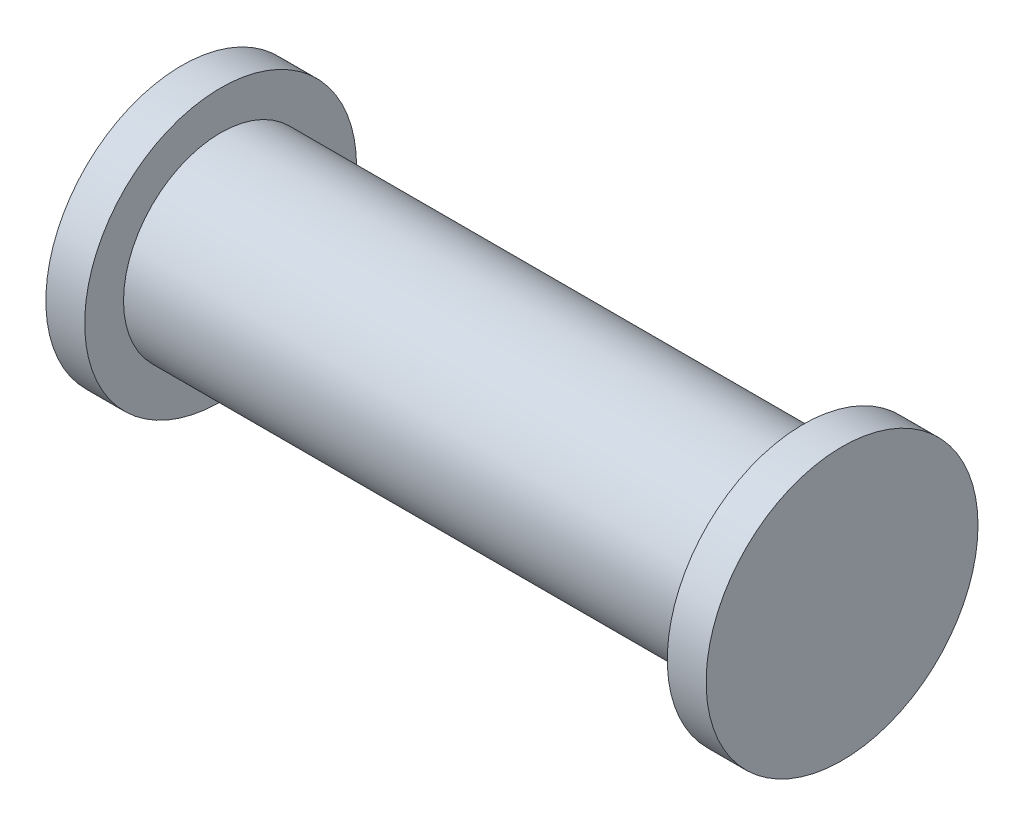
ISO-10303-21;
HEADER;
FILE_DESCRIPTION(('STEP AP214'),'2;1');
FILE_NAME('part.step','',(''),(''),'','','');
FILE_SCHEMA(('AUTOMOTIVE_DESIGN { 1 0 10303 214 1 1 1 1 }'));
ENDSEC;
DATA;
#1=APPLICATION_CONTEXT('core data for automotive mechanical design processes');
#2=APPLICATION_PROTOCOL_DEFINITION('international standard','automotive_design',2000,#1);
#3=PRODUCT_CONTEXT('',#1,'mechanical');
#4=PRODUCT('Part','Part','',(#3));
#5=PRODUCT_RELATED_PRODUCT_CATEGORY('part','',(#4));
#6=PRODUCT_DEFINITION_FORMATION('','',#4);
#7=PRODUCT_DEFINITION_CONTEXT('part definition',#1,'design');
#8=PRODUCT_DEFINITION('design','',#6,#7);
#9=PRODUCT_DEFINITION_SHAPE('','',#8);
#10=(LENGTH_UNIT() NAMED_UNIT(*) SI_UNIT(.MILLI.,.METRE.));
#11=(NAMED_UNIT(*) PLANE_ANGLE_UNIT() SI_UNIT($,.RADIAN.));
#12=(NAMED_UNIT(*) SI_UNIT($,.STERADIAN.) SOLID_ANGLE_UNIT());
#13=UNCERTAINTY_MEASURE_WITH_UNIT(LENGTH_MEASURE(1.E-05),#10,'distance_accuracy_value','');
#14=(GEOMETRIC_REPRESENTATION_CONTEXT(3) GLOBAL_UNCERTAINTY_ASSIGNED_CONTEXT((#13)) GLOBAL_UNIT_ASSIGNED_CONTEXT((#10,
#11,#12)) REPRESENTATION_CONTEXT('',''));
#15=CARTESIAN_POINT('',(0.,0.,0.));
#16=DIRECTION('',(0.,0.,1.));
#17=DIRECTION('',(1.,0.,0.));
#18=AXIS2_PLACEMENT_3D('',#15,#16,#17);
#19=CARTESIAN_POINT('',(37.5,0.,0.));
#20=DIRECTION('',(-1.,0.,0.));
#21=DIRECTION('',(0.,0.,1.));
#22=AXIS2_PLACEMENT_3D('',#19,#20,#21);
#23=CYLINDRICAL_SURFACE('',#22,12.5);
#24=CARTESIAN_POINT('',(37.5,0.,0.));
#25=DIRECTION('',(1.,0.,0.));
#26=DIRECTION('',(0.,0.,-1.));
#27=AXIS2_PLACEMENT_3D('',#24,#25,#26);
#28=CIRCLE('',#27,12.5);
#29=CARTESIAN_POINT('',(37.5,0.,-12.5));
#30=VERTEX_POINT('',#29);
#31=EDGE_CURVE('E10',#30,#30,#28,.T.);
#32=ORIENTED_EDGE('',*,*,#31,.F.);
#33=EDGE_LOOP('',(#32));
#34=FACE_BOUND('',#33,.T.);
#35=CARTESIAN_POINT('',(-37.5,0.,0.));
#36=DIRECTION('',(-1.,0.,0.));
#37=DIRECTION('',(0.,0.,1.));
#38=AXIS2_PLACEMENT_3D('',#35,#36,#37);
#39=CIRCLE('',#38,12.5);
#40=CARTESIAN_POINT('',(-37.5,0.,12.5));
#41=VERTEX_POINT('',#40);
#42=EDGE_CURVE('E48',#41,#41,#39,.T.);
#43=ORIENTED_EDGE('',*,*,#42,.F.);
#44=EDGE_LOOP('',(#43));
#45=FACE_BOUND('',#44,.T.);
#46=ADVANCED_FACE('F33',(#34,#45),#23,.T.);
#47=CARTESIAN_POINT('',(42.5,0.,0.));
#48=DIRECTION('',(-1.,0.,0.));
#49=DIRECTION('',(0.,0.,1.));
#50=AXIS2_PLACEMENT_3D('',#47,#48,#49);
#51=CYLINDRICAL_SURFACE('',#50,17.5);
#52=CARTESIAN_POINT('',(42.5,0.,0.));
#53=DIRECTION('',(1.,0.,0.));
#54=DIRECTION('',(0.,0.,-1.));
#55=AXIS2_PLACEMENT_3D('',#52,#53,#54);
#56=CIRCLE('',#55,17.5);
#57=CARTESIAN_POINT('',(42.5,0.,-17.5));
#58=VERTEX_POINT('',#57);
#59=EDGE_CURVE('E39',#58,#58,#56,.T.);
#60=ORIENTED_EDGE('',*,*,#59,.F.);
#61=EDGE_LOOP('',(#60));
#62=FACE_BOUND('',#61,.T.);
#63=CARTESIAN_POINT('',(37.5,0.,0.));
#64=DIRECTION('',(1.,0.,0.));
#65=DIRECTION('',(0.,0.,-1.));
#66=AXIS2_PLACEMENT_3D('',#63,#64,#65);
#67=CIRCLE('',#66,17.5);
#68=CARTESIAN_POINT('',(37.5,0.,-17.5));
#69=VERTEX_POINT('',#68);
#70=EDGE_CURVE('E43',#69,#69,#67,.T.);
#71=ORIENTED_EDGE('',*,*,#70,.T.);
#72=EDGE_LOOP('',(#71));
#73=FACE_BOUND('',#72,.T.);
#74=ADVANCED_FACE('F75',(#62,#73),#51,.T.);
#75=CARTESIAN_POINT('',(42.5,0.,0.));
#76=DIRECTION('',(1.,0.,0.));
#77=DIRECTION('',(0.,0.,-1.));
#78=AXIS2_PLACEMENT_3D('',#75,#76,#77);
#79=PLANE('',#78);
#80=ORIENTED_EDGE('',*,*,#59,.T.);
#81=EDGE_LOOP('',(#80));
#82=FACE_BOUND('',#81,.T.);
#83=ADVANCED_FACE('F80',(#82),#79,.T.);
#84=CARTESIAN_POINT('',(37.5,0.,0.));
#85=DIRECTION('',(1.,0.,0.));
#86=DIRECTION('',(0.,0.,-1.));
#87=AXIS2_PLACEMENT_3D('',#84,#85,#86);
#88=PLANE('',#87);
#89=ORIENTED_EDGE('',*,*,#31,.T.);
#90=EDGE_LOOP('',(#89));
#91=FACE_BOUND('',#90,.T.);
#92=ORIENTED_EDGE('',*,*,#70,.F.);
#93=EDGE_LOOP('',(#92));
#94=FACE_BOUND('',#93,.T.);
#95=ADVANCED_FACE('F72',(#91,#94),#88,.F.);
#96=CARTESIAN_POINT('',(-42.5,0.,0.));
#97=DIRECTION('',(1.,0.,0.));
#98=DIRECTION('',(0.,0.,-1.));
#99=AXIS2_PLACEMENT_3D('',#96,#97,#98);
#100=CYLINDRICAL_SURFACE('',#99,17.5);
#101=CARTESIAN_POINT('',(-42.5,0.,0.));
#102=DIRECTION('',(1.,0.,0.));
#103=DIRECTION('',(0.,0.,-1.));
#104=AXIS2_PLACEMENT_3D('',#101,#102,#103);
#105=CIRCLE('',#104,17.5);
#106=CARTESIAN_POINT('',(-42.5,0.,-17.5));
#107=VERTEX_POINT('',#106);
#108=EDGE_CURVE('E52',#107,#107,#105,.T.);
#109=ORIENTED_EDGE('',*,*,#108,.T.);
#110=EDGE_LOOP('',(#109));
#111=FACE_BOUND('',#110,.T.);
#112=CARTESIAN_POINT('',(-37.5,0.,0.));
#113=DIRECTION('',(1.,0.,0.));
#114=DIRECTION('',(0.,0.,-1.));
#115=AXIS2_PLACEMENT_3D('',#112,#113,#114);
#116=CIRCLE('',#115,17.5);
#117=CARTESIAN_POINT('',(-37.5,0.,-17.5));
#118=VERTEX_POINT('',#117);
#119=EDGE_CURVE('E53',#118,#118,#116,.T.);
#120=ORIENTED_EDGE('',*,*,#119,.F.);
#121=EDGE_LOOP('',(#120));
#122=FACE_BOUND('',#121,.T.);
#123=ADVANCED_FACE('F59',(#111,#122),#100,.T.);
#124=CARTESIAN_POINT('',(-42.5,0.,0.));
#125=DIRECTION('',(-1.,0.,0.));
#126=DIRECTION('',(0.,0.,-1.));
#127=AXIS2_PLACEMENT_3D('',#124,#125,#126);
#128=PLANE('',#127);
#129=ORIENTED_EDGE('',*,*,#108,.F.);
#130=EDGE_LOOP('',(#129));
#131=FACE_BOUND('',#130,.T.);
#132=ADVANCED_FACE('F62',(#131),#128,.T.);
#133=CARTESIAN_POINT('',(-37.5,0.,0.));
#134=DIRECTION('',(-1.,0.,0.));
#135=DIRECTION('',(0.,0.,-1.));
#136=AXIS2_PLACEMENT_3D('',#133,#134,#135);
#137=PLANE('',#136);
#138=ORIENTED_EDGE('',*,*,#42,.T.);
#139=EDGE_LOOP('',(#138));
#140=FACE_BOUND('',#139,.T.);
#141=ORIENTED_EDGE('',*,*,#119,.T.);
#142=EDGE_LOOP('',(#141));
#143=FACE_BOUND('',#142,.T.);
#144=ADVANCED_FACE('F64',(#140,#143),#137,.F.);
#145=CLOSED_SHELL('',(#46,#74,#83,#95,#123,#132,#144));
#146=MANIFOLD_SOLID_BREP('B2',#145);
#147=ADVANCED_BREP_SHAPE_REPRESENTATION('',(#18,#146),#14);
#148=SHAPE_DEFINITION_REPRESENTATION(#9,#147);
ENDSEC;
END-ISO-10303-21;
